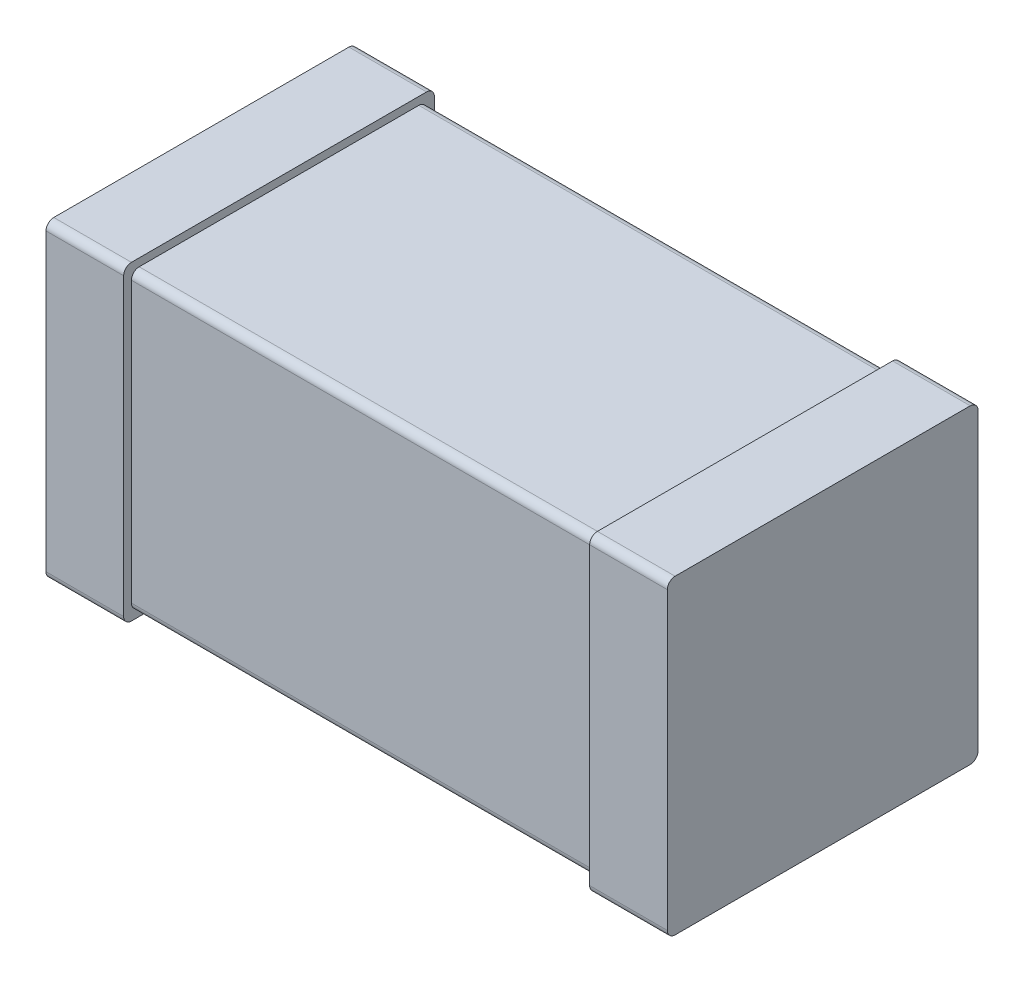
ISO-10303-21;
HEADER;
FILE_DESCRIPTION(('STEP AP214'),'2;1');
FILE_NAME('part.step','',(''),(''),'','','');
FILE_SCHEMA(('AUTOMOTIVE_DESIGN { 1 0 10303 214 1 1 1 1 }'));
ENDSEC;
DATA;
#1=APPLICATION_CONTEXT('core data for automotive mechanical design processes');
#2=APPLICATION_PROTOCOL_DEFINITION('international standard','automotive_design',2000,#1);
#3=PRODUCT_CONTEXT('',#1,'mechanical');
#4=PRODUCT('Part','Part','',(#3));
#5=PRODUCT_RELATED_PRODUCT_CATEGORY('part','',(#4));
#6=PRODUCT_DEFINITION_FORMATION('','',#4);
#7=PRODUCT_DEFINITION_CONTEXT('part definition',#1,'design');
#8=PRODUCT_DEFINITION('design','',#6,#7);
#9=PRODUCT_DEFINITION_SHAPE('','',#8);
#10=(LENGTH_UNIT() NAMED_UNIT(*) SI_UNIT(.MILLI.,.METRE.));
#11=(NAMED_UNIT(*) PLANE_ANGLE_UNIT() SI_UNIT($,.RADIAN.));
#12=(NAMED_UNIT(*) SI_UNIT($,.STERADIAN.) SOLID_ANGLE_UNIT());
#13=UNCERTAINTY_MEASURE_WITH_UNIT(LENGTH_MEASURE(1.E-05),#10,'distance_accuracy_value','');
#14=(GEOMETRIC_REPRESENTATION_CONTEXT(3) GLOBAL_UNCERTAINTY_ASSIGNED_CONTEXT((#13)) GLOBAL_UNIT_ASSIGNED_CONTEXT((#10,
#11,#12)) REPRESENTATION_CONTEXT('',''));
#15=CARTESIAN_POINT('',(0.,0.,0.));
#16=DIRECTION('',(0.,0.,1.));
#17=DIRECTION('',(1.,0.,0.));
#18=AXIS2_PLACEMENT_3D('',#15,#16,#17);
#19=CARTESIAN_POINT('',(-1.6,-0.8,0.));
#20=DIRECTION('',(1.,0.,0.));
#21=DIRECTION('',(0.,1.,0.));
#22=AXIS2_PLACEMENT_3D('',#19,#20,#21);
#23=PLANE('',#22);
#24=CARTESIAN_POINT('',(-1.6,-0.76,1.56));
#25=DIRECTION('',(-1.,0.,0.));
#26=DIRECTION('',(0.,0.,1.));
#27=AXIS2_PLACEMENT_3D('',#24,#25,#26);
#28=CIRCLE('',#27,0.04);
#29=CARTESIAN_POINT('',(-1.6,-0.8,1.56));
#30=VERTEX_POINT('',#29);
#31=CARTESIAN_POINT('',(-1.6,-0.76,1.6));
#32=VERTEX_POINT('',#31);
#33=EDGE_CURVE('E11',#30,#32,#28,.T.);
#34=ORIENTED_EDGE('',*,*,#33,.T.);
#35=DIRECTION('',(0.,1.,0.));
#36=VECTOR('',#35,1.);
#37=CARTESIAN_POINT('',(-1.6,-0.8,1.6));
#38=LINE('',#37,#36);
#39=CARTESIAN_POINT('',(-1.6,0.76,1.6));
#40=VERTEX_POINT('',#39);
#41=EDGE_CURVE('E27',#32,#40,#38,.T.);
#42=ORIENTED_EDGE('',*,*,#41,.T.);
#43=CARTESIAN_POINT('',(-1.6,0.76,1.56));
#44=DIRECTION('',(1.,0.,0.));
#45=DIRECTION('',(0.,0.,1.));
#46=AXIS2_PLACEMENT_3D('',#43,#44,#45);
#47=CIRCLE('',#46,0.04);
#48=CARTESIAN_POINT('',(-1.6,0.8,1.56));
#49=VERTEX_POINT('',#48);
#50=EDGE_CURVE('E334',#49,#40,#47,.T.);
#51=ORIENTED_EDGE('',*,*,#50,.F.);
#52=DIRECTION('',(0.,0.,1.));
#53=VECTOR('',#52,1.);
#54=CARTESIAN_POINT('',(-1.6,0.8,0.));
#55=LINE('',#54,#53);
#56=CARTESIAN_POINT('',(-1.6,0.8,0.04));
#57=VERTEX_POINT('',#56);
#58=EDGE_CURVE('E278',#57,#49,#55,.T.);
#59=ORIENTED_EDGE('',*,*,#58,.F.);
#60=CARTESIAN_POINT('',(-1.6,0.76,0.04));
#61=DIRECTION('',(-1.,0.,0.));
#62=DIRECTION('',(0.,0.,1.));
#63=AXIS2_PLACEMENT_3D('',#60,#61,#62);
#64=CIRCLE('',#63,0.04);
#65=CARTESIAN_POINT('',(-1.6,0.76,0.));
#66=VERTEX_POINT('',#65);
#67=EDGE_CURVE('E288',#57,#66,#64,.T.);
#68=ORIENTED_EDGE('',*,*,#67,.T.);
#69=DIRECTION('',(0.,1.,0.));
#70=VECTOR('',#69,1.);
#71=CARTESIAN_POINT('',(-1.6,-0.8,0.));
#72=LINE('',#71,#70);
#73=CARTESIAN_POINT('',(-1.6,-0.76,0.));
#74=VERTEX_POINT('',#73);
#75=EDGE_CURVE('E343',#74,#66,#72,.T.);
#76=ORIENTED_EDGE('',*,*,#75,.F.);
#77=CARTESIAN_POINT('',(-1.6,-0.76,0.04));
#78=DIRECTION('',(1.,0.,0.));
#79=DIRECTION('',(0.,0.,1.));
#80=AXIS2_PLACEMENT_3D('',#77,#78,#79);
#81=CIRCLE('',#80,0.04);
#82=CARTESIAN_POINT('',(-1.6,-0.8,0.04));
#83=VERTEX_POINT('',#82);
#84=EDGE_CURVE('E318',#83,#74,#81,.T.);
#85=ORIENTED_EDGE('',*,*,#84,.F.);
#86=DIRECTION('',(0.,0.,1.));
#87=VECTOR('',#86,1.);
#88=CARTESIAN_POINT('',(-1.6,-0.8,0.));
#89=LINE('',#88,#87);
#90=EDGE_CURVE('E264',#83,#30,#89,.T.);
#91=ORIENTED_EDGE('',*,*,#90,.T.);
#92=EDGE_LOOP('',(#34,#42,#51,#59,#68,#76,#85,#91));
#93=FACE_BOUND('',#92,.T.);
#94=ADVANCED_FACE('F16',(#93),#23,.F.);
#95=CARTESIAN_POINT('',(-1.6,-0.8,0.));
#96=DIRECTION('',(0.,1.,0.));
#97=DIRECTION('',(1.,0.,0.));
#98=AXIS2_PLACEMENT_3D('',#95,#96,#97);
#99=PLANE('',#98);
#100=DIRECTION('',(1.,0.,0.));
#101=VECTOR('',#100,1.);
#102=CARTESIAN_POINT('',(-1.6,-0.8,1.56));
#103=LINE('',#102,#101);
#104=CARTESIAN_POINT('',(-1.2,-0.8,1.56));
#105=VERTEX_POINT('',#104);
#106=EDGE_CURVE('E296',#30,#105,#103,.T.);
#107=ORIENTED_EDGE('',*,*,#106,.F.);
#108=ORIENTED_EDGE('',*,*,#90,.F.);
#109=DIRECTION('',(1.,0.,0.));
#110=VECTOR('',#109,1.);
#111=CARTESIAN_POINT('',(-1.6,-0.8,0.04));
#112=LINE('',#111,#110);
#113=CARTESIAN_POINT('',(-1.2,-0.8,0.04));
#114=VERTEX_POINT('',#113);
#115=EDGE_CURVE('E260',#83,#114,#112,.T.);
#116=ORIENTED_EDGE('',*,*,#115,.T.);
#117=DIRECTION('',(0.,0.,1.));
#118=VECTOR('',#117,1.);
#119=CARTESIAN_POINT('',(-1.2,-0.8,0.));
#120=LINE('',#119,#118);
#121=EDGE_CURVE('E265',#114,#105,#120,.T.);
#122=ORIENTED_EDGE('',*,*,#121,.T.);
#123=EDGE_LOOP('',(#107,#108,#116,#122));
#124=FACE_BOUND('',#123,.T.);
#125=ADVANCED_FACE('F572',(#124),#99,.F.);
#126=CARTESIAN_POINT('',(-1.6,-0.76,0.04));
#127=DIRECTION('',(1.,0.,0.));
#128=DIRECTION('',(0.,-1.,0.));
#129=AXIS2_PLACEMENT_3D('',#126,#127,#128);
#130=CYLINDRICAL_SURFACE('',#129,0.04);
#131=ORIENTED_EDGE('',*,*,#84,.T.);
#132=DIRECTION('',(1.,0.,0.));
#133=VECTOR('',#132,1.);
#134=CARTESIAN_POINT('',(-1.6,-0.76,0.));
#135=LINE('',#134,#133);
#136=CARTESIAN_POINT('',(-1.2,-0.76,0.));
#137=VERTEX_POINT('',#136);
#138=EDGE_CURVE('E322',#74,#137,#135,.T.);
#139=ORIENTED_EDGE('',*,*,#138,.T.);
#140=CARTESIAN_POINT('',(-1.2,-0.76,0.04));
#141=DIRECTION('',(1.,0.,0.));
#142=DIRECTION('',(0.,0.,1.));
#143=AXIS2_PLACEMENT_3D('',#140,#141,#142);
#144=CIRCLE('',#143,0.04);
#145=EDGE_CURVE('E279',#114,#137,#144,.T.);
#146=ORIENTED_EDGE('',*,*,#145,.F.);
#147=ORIENTED_EDGE('',*,*,#115,.F.);
#148=EDGE_LOOP('',(#131,#139,#146,#147));
#149=FACE_BOUND('',#148,.T.);
#150=ADVANCED_FACE('F576',(#149),#130,.T.);
#151=CARTESIAN_POINT('',(-1.6,-0.76,1.56));
#152=DIRECTION('',(1.,0.,0.));
#153=DIRECTION('',(0.,-1.,0.));
#154=AXIS2_PLACEMENT_3D('',#151,#152,#153);
#155=CYLINDRICAL_SURFACE('',#154,0.04);
#156=ORIENTED_EDGE('',*,*,#106,.T.);
#157=CARTESIAN_POINT('',(-1.2,-0.76,1.56));
#158=DIRECTION('',(-1.,0.,0.));
#159=DIRECTION('',(0.,0.,1.));
#160=AXIS2_PLACEMENT_3D('',#157,#158,#159);
#161=CIRCLE('',#160,0.04);
#162=CARTESIAN_POINT('',(-1.2,-0.76,1.6));
#163=VERTEX_POINT('',#162);
#164=EDGE_CURVE('E292',#105,#163,#161,.T.);
#165=ORIENTED_EDGE('',*,*,#164,.T.);
#166=DIRECTION('',(1.,0.,0.));
#167=VECTOR('',#166,1.);
#168=CARTESIAN_POINT('',(-1.6,-0.76,1.6));
#169=LINE('',#168,#167);
#170=EDGE_CURVE('E346',#32,#163,#169,.T.);
#171=ORIENTED_EDGE('',*,*,#170,.F.);
#172=ORIENTED_EDGE('',*,*,#33,.F.);
#173=EDGE_LOOP('',(#156,#165,#171,#172));
#174=FACE_BOUND('',#173,.T.);
#175=ADVANCED_FACE('F567',(#174),#155,.T.);
#176=CARTESIAN_POINT('',(-1.6,-0.8,0.));
#177=DIRECTION('',(0.,0.,1.));
#178=DIRECTION('',(1.,0.,0.));
#179=AXIS2_PLACEMENT_3D('',#176,#177,#178);
#180=PLANE('',#179);
#181=DIRECTION('',(1.,0.,0.));
#182=VECTOR('',#181,1.);
#183=CARTESIAN_POINT('',(-1.6,0.76,0.));
#184=LINE('',#183,#182);
#185=CARTESIAN_POINT('',(-1.2,0.76,0.));
#186=VERTEX_POINT('',#185);
#187=EDGE_CURVE('E297',#66,#186,#184,.T.);
#188=ORIENTED_EDGE('',*,*,#187,.T.);
#189=DIRECTION('',(0.,1.,0.));
#190=VECTOR('',#189,1.);
#191=CARTESIAN_POINT('',(-1.2,-0.8,0.));
#192=LINE('',#191,#190);
#193=EDGE_CURVE('E419',#137,#186,#192,.T.);
#194=ORIENTED_EDGE('',*,*,#193,.F.);
#195=ORIENTED_EDGE('',*,*,#138,.F.);
#196=ORIENTED_EDGE('',*,*,#75,.T.);
#197=EDGE_LOOP('',(#188,#194,#195,#196));
#198=FACE_BOUND('',#197,.T.);
#199=ADVANCED_FACE('F583',(#198),#180,.F.);
#200=CARTESIAN_POINT('',(-1.6,-0.8,1.6));
#201=DIRECTION('',(0.,0.,1.));
#202=DIRECTION('',(1.,0.,0.));
#203=AXIS2_PLACEMENT_3D('',#200,#201,#202);
#204=PLANE('',#203);
#205=ORIENTED_EDGE('',*,*,#41,.F.);
#206=ORIENTED_EDGE('',*,*,#170,.T.);
#207=DIRECTION('',(0.,1.,0.));
#208=VECTOR('',#207,1.);
#209=CARTESIAN_POINT('',(-1.2,-0.8,1.6));
#210=LINE('',#209,#208);
#211=CARTESIAN_POINT('',(-1.2,0.76,1.6));
#212=VERTEX_POINT('',#211);
#213=EDGE_CURVE('E350',#163,#212,#210,.T.);
#214=ORIENTED_EDGE('',*,*,#213,.T.);
#215=DIRECTION('',(1.,0.,0.));
#216=VECTOR('',#215,1.);
#217=CARTESIAN_POINT('',(-1.6,0.76,1.6));
#218=LINE('',#217,#216);
#219=EDGE_CURVE('E338',#40,#212,#218,.T.);
#220=ORIENTED_EDGE('',*,*,#219,.F.);
#221=EDGE_LOOP('',(#205,#206,#214,#220));
#222=FACE_BOUND('',#221,.T.);
#223=ADVANCED_FACE('F563',(#222),#204,.T.);
#224=CARTESIAN_POINT('',(-1.6,0.76,0.04));
#225=DIRECTION('',(1.,0.,0.));
#226=DIRECTION('',(0.,1.,0.));
#227=AXIS2_PLACEMENT_3D('',#224,#225,#226);
#228=CYLINDRICAL_SURFACE('',#227,0.04);
#229=DIRECTION('',(1.,0.,0.));
#230=VECTOR('',#229,1.);
#231=CARTESIAN_POINT('',(-1.6,0.8,0.04));
#232=LINE('',#231,#230);
#233=CARTESIAN_POINT('',(-1.2,0.8,0.04));
#234=VERTEX_POINT('',#233);
#235=EDGE_CURVE('E354',#57,#234,#232,.T.);
#236=ORIENTED_EDGE('',*,*,#235,.T.);
#237=CARTESIAN_POINT('',(-1.2,0.76,0.04));
#238=DIRECTION('',(-1.,0.,0.));
#239=DIRECTION('',(0.,0.,1.));
#240=AXIS2_PLACEMENT_3D('',#237,#238,#239);
#241=CIRCLE('',#240,0.04);
#242=EDGE_CURVE('E337',#234,#186,#241,.T.);
#243=ORIENTED_EDGE('',*,*,#242,.T.);
#244=ORIENTED_EDGE('',*,*,#187,.F.);
#245=ORIENTED_EDGE('',*,*,#67,.F.);
#246=EDGE_LOOP('',(#236,#243,#244,#245));
#247=FACE_BOUND('',#246,.T.);
#248=ADVANCED_FACE('F554',(#247),#228,.T.);
#249=CARTESIAN_POINT('',(-1.6,0.76,1.56));
#250=DIRECTION('',(1.,0.,0.));
#251=DIRECTION('',(0.,1.,0.));
#252=AXIS2_PLACEMENT_3D('',#249,#250,#251);
#253=CYLINDRICAL_SURFACE('',#252,0.04);
#254=ORIENTED_EDGE('',*,*,#50,.T.);
#255=ORIENTED_EDGE('',*,*,#219,.T.);
#256=CARTESIAN_POINT('',(-1.2,0.76,1.56));
#257=DIRECTION('',(1.,0.,0.));
#258=DIRECTION('',(0.,0.,1.));
#259=AXIS2_PLACEMENT_3D('',#256,#257,#258);
#260=CIRCLE('',#259,0.04);
#261=CARTESIAN_POINT('',(-1.2,0.8,1.56));
#262=VERTEX_POINT('',#261);
#263=EDGE_CURVE('E360',#262,#212,#260,.T.);
#264=ORIENTED_EDGE('',*,*,#263,.F.);
#265=DIRECTION('',(1.,0.,0.));
#266=VECTOR('',#265,1.);
#267=CARTESIAN_POINT('',(-1.6,0.8,1.56));
#268=LINE('',#267,#266);
#269=EDGE_CURVE('E274',#49,#262,#268,.T.);
#270=ORIENTED_EDGE('',*,*,#269,.F.);
#271=EDGE_LOOP('',(#254,#255,#264,#270));
#272=FACE_BOUND('',#271,.T.);
#273=ADVANCED_FACE('F562',(#272),#253,.T.);
#274=CARTESIAN_POINT('',(-1.6,0.8,0.));
#275=DIRECTION('',(0.,1.,0.));
#276=DIRECTION('',(1.,0.,0.));
#277=AXIS2_PLACEMENT_3D('',#274,#275,#276);
#278=PLANE('',#277);
#279=DIRECTION('',(0.,0.,1.));
#280=VECTOR('',#279,1.);
#281=CARTESIAN_POINT('',(-1.2,0.8,0.));
#282=LINE('',#281,#280);
#283=EDGE_CURVE('E364',#234,#262,#282,.T.);
#284=ORIENTED_EDGE('',*,*,#283,.F.);
#285=ORIENTED_EDGE('',*,*,#235,.F.);
#286=ORIENTED_EDGE('',*,*,#58,.T.);
#287=ORIENTED_EDGE('',*,*,#269,.T.);
#288=EDGE_LOOP('',(#284,#285,#286,#287));
#289=FACE_BOUND('',#288,.T.);
#290=ADVANCED_FACE('F556',(#289),#278,.T.);
#291=CARTESIAN_POINT('',(-1.2,-0.8,0.));
#292=DIRECTION('',(1.,0.,0.));
#293=DIRECTION('',(0.,1.,0.));
#294=AXIS2_PLACEMENT_3D('',#291,#292,#293);
#295=PLANE('',#294);
#296=ORIENTED_EDGE('',*,*,#121,.F.);
#297=ORIENTED_EDGE('',*,*,#145,.T.);
#298=ORIENTED_EDGE('',*,*,#193,.T.);
#299=ORIENTED_EDGE('',*,*,#242,.F.);
#300=ORIENTED_EDGE('',*,*,#283,.T.);
#301=ORIENTED_EDGE('',*,*,#263,.T.);
#302=ORIENTED_EDGE('',*,*,#213,.F.);
#303=ORIENTED_EDGE('',*,*,#164,.F.);
#304=EDGE_LOOP('',(#296,#297,#298,#299,#300,#301,#302,#303));
#305=FACE_BOUND('',#304,.T.);
#306=CARTESIAN_POINT('',(-1.2,-0.72,0.08));
#307=DIRECTION('',(1.,0.,0.));
#308=DIRECTION('',(0.,0.,1.));
#309=AXIS2_PLACEMENT_3D('',#306,#307,#308);
#310=CIRCLE('',#309,0.04);
#311=CARTESIAN_POINT('',(-1.2,-0.76,0.08));
#312=VERTEX_POINT('',#311);
#313=CARTESIAN_POINT('',(-1.2,-0.72,0.04));
#314=VERTEX_POINT('',#313);
#315=EDGE_CURVE('E244',#312,#314,#310,.T.);
#316=ORIENTED_EDGE('',*,*,#315,.F.);
#317=DIRECTION('',(0.,0.,1.));
#318=VECTOR('',#317,1.);
#319=CARTESIAN_POINT('',(-1.2,-0.76,0.04));
#320=LINE('',#319,#318);
#321=CARTESIAN_POINT('',(-1.2,-0.76,1.52));
#322=VERTEX_POINT('',#321);
#323=EDGE_CURVE('E272',#312,#322,#320,.T.);
#324=ORIENTED_EDGE('',*,*,#323,.T.);
#325=CARTESIAN_POINT('',(-1.2,-0.72,1.52));
#326=DIRECTION('',(-1.,0.,0.));
#327=DIRECTION('',(0.,0.,1.));
#328=AXIS2_PLACEMENT_3D('',#325,#326,#327);
#329=CIRCLE('',#328,0.04);
#330=CARTESIAN_POINT('',(-1.2,-0.72,1.56));
#331=VERTEX_POINT('',#330);
#332=EDGE_CURVE('E268',#322,#331,#329,.T.);
#333=ORIENTED_EDGE('',*,*,#332,.T.);
#334=DIRECTION('',(0.,1.,0.));
#335=VECTOR('',#334,1.);
#336=CARTESIAN_POINT('',(-1.2,-0.76,1.56));
#337=LINE('',#336,#335);
#338=CARTESIAN_POINT('',(-1.2,0.72,1.56));
#339=VERTEX_POINT('',#338);
#340=EDGE_CURVE('E273',#331,#339,#337,.T.);
#341=ORIENTED_EDGE('',*,*,#340,.T.);
#342=CARTESIAN_POINT('',(-1.2,0.72,1.52));
#343=DIRECTION('',(1.,0.,0.));
#344=DIRECTION('',(0.,0.,1.));
#345=AXIS2_PLACEMENT_3D('',#342,#343,#344);
#346=CIRCLE('',#345,0.04);
#347=CARTESIAN_POINT('',(-1.2,0.76,1.52));
#348=VERTEX_POINT('',#347);
#349=EDGE_CURVE('E254',#348,#339,#346,.T.);
#350=ORIENTED_EDGE('',*,*,#349,.F.);
#351=DIRECTION('',(0.,0.,1.));
#352=VECTOR('',#351,1.);
#353=CARTESIAN_POINT('',(-1.2,0.76,0.04));
#354=LINE('',#353,#352);
#355=CARTESIAN_POINT('',(-1.2,0.76,0.08));
#356=VERTEX_POINT('',#355);
#357=EDGE_CURVE('E253',#356,#348,#354,.T.);
#358=ORIENTED_EDGE('',*,*,#357,.F.);
#359=CARTESIAN_POINT('',(-1.2,0.72,0.08));
#360=DIRECTION('',(-1.,0.,0.));
#361=DIRECTION('',(0.,0.,1.));
#362=AXIS2_PLACEMENT_3D('',#359,#360,#361);
#363=CIRCLE('',#362,0.04);
#364=CARTESIAN_POINT('',(-1.2,0.72,0.04));
#365=VERTEX_POINT('',#364);
#366=EDGE_CURVE('E247',#356,#365,#363,.T.);
#367=ORIENTED_EDGE('',*,*,#366,.T.);
#368=DIRECTION('',(0.,1.,0.));
#369=VECTOR('',#368,1.);
#370=CARTESIAN_POINT('',(-1.2,-0.76,0.04));
#371=LINE('',#370,#369);
#372=EDGE_CURVE('E396',#314,#365,#371,.T.);
#373=ORIENTED_EDGE('',*,*,#372,.F.);
#374=EDGE_LOOP('',(#316,#324,#333,#341,#350,#358,#367,#373));
#375=FACE_BOUND('',#374,.T.);
#376=ADVANCED_FACE('F445',(#305,#375),#295,.T.);
#377=CARTESIAN_POINT('',(-1.2,-0.72,0.08));
#378=DIRECTION('',(1.,0.,0.));
#379=DIRECTION('',(0.,-1.,0.));
#380=AXIS2_PLACEMENT_3D('',#377,#378,#379);
#381=CYLINDRICAL_SURFACE('',#380,0.04);
#382=ORIENTED_EDGE('',*,*,#315,.T.);
#383=DIRECTION('',(1.,0.,0.));
#384=VECTOR('',#383,1.);
#385=CARTESIAN_POINT('',(-1.2,-0.72,0.04));
#386=LINE('',#385,#384);
#387=CARTESIAN_POINT('',(1.2,-0.72,0.04));
#388=VERTEX_POINT('',#387);
#389=EDGE_CURVE('E248',#314,#388,#386,.T.);
#390=ORIENTED_EDGE('',*,*,#389,.T.);
#391=CARTESIAN_POINT('',(1.2,-0.72,0.08));
#392=DIRECTION('',(1.,0.,0.));
#393=DIRECTION('',(0.,0.,1.));
#394=AXIS2_PLACEMENT_3D('',#391,#392,#393);
#395=CIRCLE('',#394,0.04);
#396=CARTESIAN_POINT('',(1.2,-0.76,0.08));
#397=VERTEX_POINT('',#396);
#398=EDGE_CURVE('E370',#397,#388,#395,.T.);
#399=ORIENTED_EDGE('',*,*,#398,.F.);
#400=DIRECTION('',(1.,0.,0.));
#401=VECTOR('',#400,1.);
#402=CARTESIAN_POINT('',(-1.2,-0.76,0.08));
#403=LINE('',#402,#401);
#404=EDGE_CURVE('E311',#312,#397,#403,.T.);
#405=ORIENTED_EDGE('',*,*,#404,.F.);
#406=EDGE_LOOP('',(#382,#390,#399,#405));
#407=FACE_BOUND('',#406,.T.);
#408=ADVANCED_FACE('F493',(#407),#381,.T.);
#409=CARTESIAN_POINT('',(-1.2,-0.76,0.04));
#410=DIRECTION('',(0.,0.,1.));
#411=DIRECTION('',(1.,0.,0.));
#412=AXIS2_PLACEMENT_3D('',#409,#410,#411);
#413=PLANE('',#412);
#414=DIRECTION('',(1.,0.,0.));
#415=VECTOR('',#414,1.);
#416=CARTESIAN_POINT('',(-1.2,0.72,0.04));
#417=LINE('',#416,#415);
#418=CARTESIAN_POINT('',(1.2,0.72,0.04));
#419=VERTEX_POINT('',#418);
#420=EDGE_CURVE('E342',#365,#419,#417,.T.);
#421=ORIENTED_EDGE('',*,*,#420,.T.);
#422=DIRECTION('',(0.,1.,0.));
#423=VECTOR('',#422,1.);
#424=CARTESIAN_POINT('',(1.2,-0.76,0.04));
#425=LINE('',#424,#423);
#426=EDGE_CURVE('E214',#388,#419,#425,.T.);
#427=ORIENTED_EDGE('',*,*,#426,.F.);
#428=ORIENTED_EDGE('',*,*,#389,.F.);
#429=ORIENTED_EDGE('',*,*,#372,.T.);
#430=EDGE_LOOP('',(#421,#427,#428,#429));
#431=FACE_BOUND('',#430,.T.);
#432=ADVANCED_FACE('F495',(#431),#413,.F.);
#433=CARTESIAN_POINT('',(-1.2,0.72,0.08));
#434=DIRECTION('',(1.,0.,0.));
#435=DIRECTION('',(0.,1.,0.));
#436=AXIS2_PLACEMENT_3D('',#433,#434,#435);
#437=CYLINDRICAL_SURFACE('',#436,0.04);
#438=DIRECTION('',(1.,0.,0.));
#439=VECTOR('',#438,1.);
#440=CARTESIAN_POINT('',(-1.2,0.76,0.08));
#441=LINE('',#440,#439);
#442=CARTESIAN_POINT('',(1.2,0.76,0.08));
#443=VERTEX_POINT('',#442);
#444=EDGE_CURVE('E393',#356,#443,#441,.T.);
#445=ORIENTED_EDGE('',*,*,#444,.T.);
#446=CARTESIAN_POINT('',(1.2,0.72,0.08));
#447=DIRECTION('',(-1.,0.,0.));
#448=DIRECTION('',(0.,0.,1.));
#449=AXIS2_PLACEMENT_3D('',#446,#447,#448);
#450=CIRCLE('',#449,0.04);
#451=EDGE_CURVE('E242',#443,#419,#450,.T.);
#452=ORIENTED_EDGE('',*,*,#451,.T.);
#453=ORIENTED_EDGE('',*,*,#420,.F.);
#454=ORIENTED_EDGE('',*,*,#366,.F.);
#455=EDGE_LOOP('',(#445,#452,#453,#454));
#456=FACE_BOUND('',#455,.T.);
#457=ADVANCED_FACE('F607',(#456),#437,.T.);
#458=CARTESIAN_POINT('',(-1.2,0.76,0.04));
#459=DIRECTION('',(0.,1.,0.));
#460=DIRECTION('',(1.,0.,0.));
#461=AXIS2_PLACEMENT_3D('',#458,#459,#460);
#462=PLANE('',#461);
#463=DIRECTION('',(0.,0.,1.));
#464=VECTOR('',#463,1.);
#465=CARTESIAN_POINT('',(1.2,0.76,0.04));
#466=LINE('',#465,#464);
#467=CARTESIAN_POINT('',(1.2,0.76,1.52));
#468=VERTEX_POINT('',#467);
#469=EDGE_CURVE('E280',#443,#468,#466,.T.);
#470=ORIENTED_EDGE('',*,*,#469,.F.);
#471=ORIENTED_EDGE('',*,*,#444,.F.);
#472=ORIENTED_EDGE('',*,*,#357,.T.);
#473=DIRECTION('',(1.,0.,0.));
#474=VECTOR('',#473,1.);
#475=CARTESIAN_POINT('',(-1.2,0.76,1.52));
#476=LINE('',#475,#474);
#477=EDGE_CURVE('E249',#348,#468,#476,.T.);
#478=ORIENTED_EDGE('',*,*,#477,.T.);
#479=EDGE_LOOP('',(#470,#471,#472,#478));
#480=FACE_BOUND('',#479,.T.);
#481=ADVANCED_FACE('F603',(#480),#462,.T.);
#482=CARTESIAN_POINT('',(-1.2,0.72,1.52));
#483=DIRECTION('',(1.,0.,0.));
#484=DIRECTION('',(0.,1.,0.));
#485=AXIS2_PLACEMENT_3D('',#482,#483,#484);
#486=CYLINDRICAL_SURFACE('',#485,0.04);
#487=ORIENTED_EDGE('',*,*,#349,.T.);
#488=DIRECTION('',(1.,0.,0.));
#489=VECTOR('',#488,1.);
#490=CARTESIAN_POINT('',(-1.2,0.72,1.56));
#491=LINE('',#490,#489);
#492=CARTESIAN_POINT('',(1.2,0.72,1.56));
#493=VERTEX_POINT('',#492);
#494=EDGE_CURVE('E323',#339,#493,#491,.T.);
#495=ORIENTED_EDGE('',*,*,#494,.T.);
#496=CARTESIAN_POINT('',(1.2,0.72,1.52));
#497=DIRECTION('',(1.,0.,0.));
#498=DIRECTION('',(0.,0.,1.));
#499=AXIS2_PLACEMENT_3D('',#496,#497,#498);
#500=CIRCLE('',#499,0.04);
#501=EDGE_CURVE('E284',#468,#493,#500,.T.);
#502=ORIENTED_EDGE('',*,*,#501,.F.);
#503=ORIENTED_EDGE('',*,*,#477,.F.);
#504=EDGE_LOOP('',(#487,#495,#502,#503));
#505=FACE_BOUND('',#504,.T.);
#506=ADVANCED_FACE('F606',(#505),#486,.T.);
#507=CARTESIAN_POINT('',(-1.2,-0.76,1.56));
#508=DIRECTION('',(0.,0.,1.));
#509=DIRECTION('',(1.,0.,0.));
#510=AXIS2_PLACEMENT_3D('',#507,#508,#509);
#511=PLANE('',#510);
#512=ORIENTED_EDGE('',*,*,#340,.F.);
#513=DIRECTION('',(1.,0.,0.));
#514=VECTOR('',#513,1.);
#515=CARTESIAN_POINT('',(-1.2,-0.72,1.56));
#516=LINE('',#515,#514);
#517=CARTESIAN_POINT('',(1.2,-0.72,1.56));
#518=VERTEX_POINT('',#517);
#519=EDGE_CURVE('E326',#331,#518,#516,.T.);
#520=ORIENTED_EDGE('',*,*,#519,.T.);
#521=DIRECTION('',(0.,1.,0.));
#522=VECTOR('',#521,1.);
#523=CARTESIAN_POINT('',(1.2,-0.76,1.56));
#524=LINE('',#523,#522);
#525=EDGE_CURVE('E384',#518,#493,#524,.T.);
#526=ORIENTED_EDGE('',*,*,#525,.T.);
#527=ORIENTED_EDGE('',*,*,#494,.F.);
#528=EDGE_LOOP('',(#512,#520,#526,#527));
#529=FACE_BOUND('',#528,.T.);
#530=ADVANCED_FACE('F456',(#529),#511,.T.);
#531=CARTESIAN_POINT('',(-1.2,-0.72,1.52));
#532=DIRECTION('',(1.,0.,0.));
#533=DIRECTION('',(0.,-1.,0.));
#534=AXIS2_PLACEMENT_3D('',#531,#532,#533);
#535=CYLINDRICAL_SURFACE('',#534,0.04);
#536=DIRECTION('',(1.,0.,0.));
#537=VECTOR('',#536,1.);
#538=CARTESIAN_POINT('',(-1.2,-0.76,1.52));
#539=LINE('',#538,#537);
#540=CARTESIAN_POINT('',(1.2,-0.76,1.52));
#541=VERTEX_POINT('',#540);
#542=EDGE_CURVE('E380',#322,#541,#539,.T.);
#543=ORIENTED_EDGE('',*,*,#542,.T.);
#544=CARTESIAN_POINT('',(1.2,-0.72,1.52));
#545=DIRECTION('',(-1.,0.,0.));
#546=DIRECTION('',(0.,0.,1.));
#547=AXIS2_PLACEMENT_3D('',#544,#545,#546);
#548=CIRCLE('',#547,0.04);
#549=EDGE_CURVE('E333',#541,#518,#548,.T.);
#550=ORIENTED_EDGE('',*,*,#549,.T.);
#551=ORIENTED_EDGE('',*,*,#519,.F.);
#552=ORIENTED_EDGE('',*,*,#332,.F.);
#553=EDGE_LOOP('',(#543,#550,#551,#552));
#554=FACE_BOUND('',#553,.T.);
#555=ADVANCED_FACE('F454',(#554),#535,.T.);
#556=CARTESIAN_POINT('',(-1.2,-0.76,0.04));
#557=DIRECTION('',(0.,1.,0.));
#558=DIRECTION('',(1.,0.,0.));
#559=AXIS2_PLACEMENT_3D('',#556,#557,#558);
#560=PLANE('',#559);
#561=ORIENTED_EDGE('',*,*,#542,.F.);
#562=ORIENTED_EDGE('',*,*,#323,.F.);
#563=ORIENTED_EDGE('',*,*,#404,.T.);
#564=DIRECTION('',(0.,0.,1.));
#565=VECTOR('',#564,1.);
#566=CARTESIAN_POINT('',(1.2,-0.76,0.04));
#567=LINE('',#566,#565);
#568=EDGE_CURVE('E221',#397,#541,#567,.T.);
#569=ORIENTED_EDGE('',*,*,#568,.T.);
#570=EDGE_LOOP('',(#561,#562,#563,#569));
#571=FACE_BOUND('',#570,.T.);
#572=ADVANCED_FACE('F450',(#571),#560,.F.);
#573=CARTESIAN_POINT('',(1.2,-0.8,0.));
#574=DIRECTION('',(1.,0.,0.));
#575=DIRECTION('',(0.,1.,0.));
#576=AXIS2_PLACEMENT_3D('',#573,#574,#575);
#577=PLANE('',#576);
#578=CARTESIAN_POINT('',(1.2,-0.76,1.56));
#579=DIRECTION('',(-1.,0.,0.));
#580=DIRECTION('',(0.,0.,1.));
#581=AXIS2_PLACEMENT_3D('',#578,#579,#580);
#582=CIRCLE('',#581,0.04);
#583=CARTESIAN_POINT('',(1.2,-0.8,1.56));
#584=VERTEX_POINT('',#583);
#585=CARTESIAN_POINT('',(1.2,-0.76,1.6));
#586=VERTEX_POINT('',#585);
#587=EDGE_CURVE('E205',#584,#586,#582,.T.);
#588=ORIENTED_EDGE('',*,*,#587,.T.);
#589=DIRECTION('',(0.,1.,0.));
#590=VECTOR('',#589,1.);
#591=CARTESIAN_POINT('',(1.2,-0.8,1.6));
#592=LINE('',#591,#590);
#593=CARTESIAN_POINT('',(1.2,0.76,1.6));
#594=VERTEX_POINT('',#593);
#595=EDGE_CURVE('E222',#586,#594,#592,.T.);
#596=ORIENTED_EDGE('',*,*,#595,.T.);
#597=CARTESIAN_POINT('',(1.2,0.76,1.56));
#598=DIRECTION('',(1.,0.,0.));
#599=DIRECTION('',(0.,0.,1.));
#600=AXIS2_PLACEMENT_3D('',#597,#598,#599);
#601=CIRCLE('',#600,0.04);
#602=CARTESIAN_POINT('',(1.2,0.8,1.56));
#603=VERTEX_POINT('',#602);
#604=EDGE_CURVE('E257',#603,#594,#601,.T.);
#605=ORIENTED_EDGE('',*,*,#604,.F.);
#606=DIRECTION('',(0.,0.,1.));
#607=VECTOR('',#606,1.);
#608=CARTESIAN_POINT('',(1.2,0.8,0.));
#609=LINE('',#608,#607);
#610=CARTESIAN_POINT('',(1.2,0.8,0.04));
#611=VERTEX_POINT('',#610);
#612=EDGE_CURVE('E258',#611,#603,#609,.T.);
#613=ORIENTED_EDGE('',*,*,#612,.F.);
#614=CARTESIAN_POINT('',(1.2,0.76,0.04));
#615=DIRECTION('',(-1.,0.,0.));
#616=DIRECTION('',(0.,0.,1.));
#617=AXIS2_PLACEMENT_3D('',#614,#615,#616);
#618=CIRCLE('',#617,0.04);
#619=CARTESIAN_POINT('',(1.2,0.76,0.));
#620=VERTEX_POINT('',#619);
#621=EDGE_CURVE('E213',#611,#620,#618,.T.);
#622=ORIENTED_EDGE('',*,*,#621,.T.);
#623=DIRECTION('',(0.,1.,0.));
#624=VECTOR('',#623,1.);
#625=CARTESIAN_POINT('',(1.2,-0.8,0.));
#626=LINE('',#625,#624);
#627=CARTESIAN_POINT('',(1.2,-0.76,0.));
#628=VERTEX_POINT('',#627);
#629=EDGE_CURVE('E304',#628,#620,#626,.T.);
#630=ORIENTED_EDGE('',*,*,#629,.F.);
#631=CARTESIAN_POINT('',(1.2,-0.76,0.04));
#632=DIRECTION('',(1.,0.,0.));
#633=DIRECTION('',(0.,0.,1.));
#634=AXIS2_PLACEMENT_3D('',#631,#632,#633);
#635=CIRCLE('',#634,0.04);
#636=CARTESIAN_POINT('',(1.2,-0.8,0.04));
#637=VERTEX_POINT('',#636);
#638=EDGE_CURVE('E207',#637,#628,#635,.T.);
#639=ORIENTED_EDGE('',*,*,#638,.F.);
#640=DIRECTION('',(0.,0.,1.));
#641=VECTOR('',#640,1.);
#642=CARTESIAN_POINT('',(1.2,-0.8,0.));
#643=LINE('',#642,#641);
#644=EDGE_CURVE('E200',#637,#584,#643,.T.);
#645=ORIENTED_EDGE('',*,*,#644,.T.);
#646=EDGE_LOOP('',(#588,#596,#605,#613,#622,#630,#639,#645));
#647=FACE_BOUND('',#646,.T.);
#648=ORIENTED_EDGE('',*,*,#426,.T.);
#649=ORIENTED_EDGE('',*,*,#451,.F.);
#650=ORIENTED_EDGE('',*,*,#469,.T.);
#651=ORIENTED_EDGE('',*,*,#501,.T.);
#652=ORIENTED_EDGE('',*,*,#525,.F.);
#653=ORIENTED_EDGE('',*,*,#549,.F.);
#654=ORIENTED_EDGE('',*,*,#568,.F.);
#655=ORIENTED_EDGE('',*,*,#398,.T.);
#656=EDGE_LOOP('',(#648,#649,#650,#651,#652,#653,#654,#655));
#657=FACE_BOUND('',#656,.T.);
#658=ADVANCED_FACE('F202',(#647,#657),#577,.F.);
#659=CARTESIAN_POINT('',(1.2,-0.8,0.));
#660=DIRECTION('',(0.,1.,0.));
#661=DIRECTION('',(1.,0.,0.));
#662=AXIS2_PLACEMENT_3D('',#659,#660,#661);
#663=PLANE('',#662);
#664=DIRECTION('',(1.,0.,0.));
#665=VECTOR('',#664,1.);
#666=CARTESIAN_POINT('',(1.2,-0.8,1.56));
#667=LINE('',#666,#665);
#668=CARTESIAN_POINT('',(1.6,-0.8,1.56));
#669=VERTEX_POINT('',#668);
#670=EDGE_CURVE('E218',#584,#669,#667,.T.);
#671=ORIENTED_EDGE('',*,*,#670,.F.);
#672=ORIENTED_EDGE('',*,*,#644,.F.);
#673=DIRECTION('',(1.,0.,0.));
#674=VECTOR('',#673,1.);
#675=CARTESIAN_POINT('',(1.2,-0.8,0.04));
#676=LINE('',#675,#674);
#677=CARTESIAN_POINT('',(1.6,-0.8,0.04));
#678=VERTEX_POINT('',#677);
#679=EDGE_CURVE('E367',#637,#678,#676,.T.);
#680=ORIENTED_EDGE('',*,*,#679,.T.);
#681=DIRECTION('',(0.,0.,1.));
#682=VECTOR('',#681,1.);
#683=CARTESIAN_POINT('',(1.6,-0.8,0.));
#684=LINE('',#683,#682);
#685=EDGE_CURVE('E225',#678,#669,#684,.T.);
#686=ORIENTED_EDGE('',*,*,#685,.T.);
#687=EDGE_LOOP('',(#671,#672,#680,#686));
#688=FACE_BOUND('',#687,.T.);
#689=ADVANCED_FACE('F224',(#688),#663,.F.);
#690=CARTESIAN_POINT('',(1.2,-0.76,0.04));
#691=DIRECTION('',(1.,0.,0.));
#692=DIRECTION('',(0.,-1.,0.));
#693=AXIS2_PLACEMENT_3D('',#690,#691,#692);
#694=CYLINDRICAL_SURFACE('',#693,0.04);
#695=ORIENTED_EDGE('',*,*,#638,.T.);
#696=DIRECTION('',(1.,0.,0.));
#697=VECTOR('',#696,1.);
#698=CARTESIAN_POINT('',(1.2,-0.76,0.));
#699=LINE('',#698,#697);
#700=CARTESIAN_POINT('',(1.6,-0.76,0.));
#701=VERTEX_POINT('',#700);
#702=EDGE_CURVE('E228',#628,#701,#699,.T.);
#703=ORIENTED_EDGE('',*,*,#702,.T.);
#704=CARTESIAN_POINT('',(1.6,-0.76,0.04));
#705=DIRECTION('',(1.,0.,0.));
#706=DIRECTION('',(0.,0.,1.));
#707=AXIS2_PLACEMENT_3D('',#704,#705,#706);
#708=CIRCLE('',#707,0.04);
#709=EDGE_CURVE('E392',#678,#701,#708,.T.);
#710=ORIENTED_EDGE('',*,*,#709,.F.);
#711=ORIENTED_EDGE('',*,*,#679,.F.);
#712=EDGE_LOOP('',(#695,#703,#710,#711));
#713=FACE_BOUND('',#712,.T.);
#714=ADVANCED_FACE('F18',(#713),#694,.T.);
#715=CARTESIAN_POINT('',(1.2,-0.76,1.56));
#716=DIRECTION('',(1.,0.,0.));
#717=DIRECTION('',(0.,-1.,0.));
#718=AXIS2_PLACEMENT_3D('',#715,#716,#717);
#719=CYLINDRICAL_SURFACE('',#718,0.04);
#720=ORIENTED_EDGE('',*,*,#670,.T.);
#721=CARTESIAN_POINT('',(1.6,-0.76,1.56));
#722=DIRECTION('',(-1.,0.,0.));
#723=DIRECTION('',(0.,0.,1.));
#724=AXIS2_PLACEMENT_3D('',#721,#722,#723);
#725=CIRCLE('',#724,0.04);
#726=CARTESIAN_POINT('',(1.6,-0.76,1.6));
#727=VERTEX_POINT('',#726);
#728=EDGE_CURVE('E229',#669,#727,#725,.T.);
#729=ORIENTED_EDGE('',*,*,#728,.T.);
#730=DIRECTION('',(1.,0.,0.));
#731=VECTOR('',#730,1.);
#732=CARTESIAN_POINT('',(1.2,-0.76,1.6));
#733=LINE('',#732,#731);
#734=EDGE_CURVE('E156',#586,#727,#733,.T.);
#735=ORIENTED_EDGE('',*,*,#734,.F.);
#736=ORIENTED_EDGE('',*,*,#587,.F.);
#737=EDGE_LOOP('',(#720,#729,#735,#736));
#738=FACE_BOUND('',#737,.T.);
#739=ADVANCED_FACE('F217',(#738),#719,.T.);
#740=CARTESIAN_POINT('',(1.2,-0.8,0.));
#741=DIRECTION('',(0.,0.,1.));
#742=DIRECTION('',(1.,0.,0.));
#743=AXIS2_PLACEMENT_3D('',#740,#741,#742);
#744=PLANE('',#743);
#745=DIRECTION('',(1.,0.,0.));
#746=VECTOR('',#745,1.);
#747=CARTESIAN_POINT('',(1.2,0.76,0.));
#748=LINE('',#747,#746);
#749=CARTESIAN_POINT('',(1.6,0.76,0.));
#750=VERTEX_POINT('',#749);
#751=EDGE_CURVE('E238',#620,#750,#748,.T.);
#752=ORIENTED_EDGE('',*,*,#751,.T.);
#753=DIRECTION('',(0.,1.,0.));
#754=VECTOR('',#753,1.);
#755=CARTESIAN_POINT('',(1.6,-0.8,0.));
#756=LINE('',#755,#754);
#757=EDGE_CURVE('E167',#701,#750,#756,.T.);
#758=ORIENTED_EDGE('',*,*,#757,.F.);
#759=ORIENTED_EDGE('',*,*,#702,.F.);
#760=ORIENTED_EDGE('',*,*,#629,.T.);
#761=EDGE_LOOP('',(#752,#758,#759,#760));
#762=FACE_BOUND('',#761,.T.);
#763=ADVANCED_FACE('F643',(#762),#744,.F.);
#764=CARTESIAN_POINT('',(1.2,-0.8,1.6));
#765=DIRECTION('',(0.,0.,1.));
#766=DIRECTION('',(1.,0.,0.));
#767=AXIS2_PLACEMENT_3D('',#764,#765,#766);
#768=PLANE('',#767);
#769=ORIENTED_EDGE('',*,*,#595,.F.);
#770=ORIENTED_EDGE('',*,*,#734,.T.);
#771=DIRECTION('',(0.,1.,0.));
#772=VECTOR('',#771,1.);
#773=CARTESIAN_POINT('',(1.6,-0.8,1.6));
#774=LINE('',#773,#772);
#775=CARTESIAN_POINT('',(1.6,0.76,1.6));
#776=VERTEX_POINT('',#775);
#777=EDGE_CURVE('E305',#727,#776,#774,.T.);
#778=ORIENTED_EDGE('',*,*,#777,.T.);
#779=DIRECTION('',(1.,0.,0.));
#780=VECTOR('',#779,1.);
#781=CARTESIAN_POINT('',(1.2,0.76,1.6));
#782=LINE('',#781,#780);
#783=EDGE_CURVE('E255',#594,#776,#782,.T.);
#784=ORIENTED_EDGE('',*,*,#783,.F.);
#785=EDGE_LOOP('',(#769,#770,#778,#784));
#786=FACE_BOUND('',#785,.T.);
#787=ADVANCED_FACE('F614',(#786),#768,.T.);
#788=CARTESIAN_POINT('',(1.2,0.76,0.04));
#789=DIRECTION('',(1.,0.,0.));
#790=DIRECTION('',(0.,1.,0.));
#791=AXIS2_PLACEMENT_3D('',#788,#789,#790);
#792=CYLINDRICAL_SURFACE('',#791,0.04);
#793=DIRECTION('',(1.,0.,0.));
#794=VECTOR('',#793,1.);
#795=CARTESIAN_POINT('',(1.2,0.8,0.04));
#796=LINE('',#795,#794);
#797=CARTESIAN_POINT('',(1.6,0.8,0.04));
#798=VERTEX_POINT('',#797);
#799=EDGE_CURVE('E20',#611,#798,#796,.T.);
#800=ORIENTED_EDGE('',*,*,#799,.T.);
#801=CARTESIAN_POINT('',(1.6,0.76,0.04));
#802=DIRECTION('',(-1.,0.,0.));
#803=DIRECTION('',(0.,0.,1.));
#804=AXIS2_PLACEMENT_3D('',#801,#802,#803);
#805=CIRCLE('',#804,0.04);
#806=EDGE_CURVE('E314',#798,#750,#805,.T.);
#807=ORIENTED_EDGE('',*,*,#806,.T.);
#808=ORIENTED_EDGE('',*,*,#751,.F.);
#809=ORIENTED_EDGE('',*,*,#621,.F.);
#810=EDGE_LOOP('',(#800,#807,#808,#809));
#811=FACE_BOUND('',#810,.T.);
#812=ADVANCED_FACE('F611',(#811),#792,.T.);
#813=CARTESIAN_POINT('',(1.2,0.76,1.56));
#814=DIRECTION('',(1.,0.,0.));
#815=DIRECTION('',(0.,1.,0.));
#816=AXIS2_PLACEMENT_3D('',#813,#814,#815);
#817=CYLINDRICAL_SURFACE('',#816,0.04);
#818=ORIENTED_EDGE('',*,*,#604,.T.);
#819=ORIENTED_EDGE('',*,*,#783,.T.);
#820=CARTESIAN_POINT('',(1.6,0.76,1.56));
#821=DIRECTION('',(1.,0.,0.));
#822=DIRECTION('',(0.,0.,1.));
#823=AXIS2_PLACEMENT_3D('',#820,#821,#822);
#824=CIRCLE('',#823,0.04);
#825=CARTESIAN_POINT('',(1.6,0.8,1.56));
#826=VERTEX_POINT('',#825);
#827=EDGE_CURVE('E474',#826,#776,#824,.T.);
#828=ORIENTED_EDGE('',*,*,#827,.F.);
#829=DIRECTION('',(1.,0.,0.));
#830=VECTOR('',#829,1.);
#831=CARTESIAN_POINT('',(1.2,0.8,1.56));
#832=LINE('',#831,#830);
#833=EDGE_CURVE('E301',#603,#826,#832,.T.);
#834=ORIENTED_EDGE('',*,*,#833,.F.);
#835=EDGE_LOOP('',(#818,#819,#828,#834));
#836=FACE_BOUND('',#835,.T.);
#837=ADVANCED_FACE('F533',(#836),#817,.T.);
#838=CARTESIAN_POINT('',(1.2,0.8,0.));
#839=DIRECTION('',(0.,1.,0.));
#840=DIRECTION('',(1.,0.,0.));
#841=AXIS2_PLACEMENT_3D('',#838,#839,#840);
#842=PLANE('',#841);
#843=DIRECTION('',(0.,0.,1.));
#844=VECTOR('',#843,1.);
#845=CARTESIAN_POINT('',(1.6,0.8,0.));
#846=LINE('',#845,#844);
#847=EDGE_CURVE('E522',#798,#826,#846,.T.);
#848=ORIENTED_EDGE('',*,*,#847,.F.);
#849=ORIENTED_EDGE('',*,*,#799,.F.);
#850=ORIENTED_EDGE('',*,*,#612,.T.);
#851=ORIENTED_EDGE('',*,*,#833,.T.);
#852=EDGE_LOOP('',(#848,#849,#850,#851));
#853=FACE_BOUND('',#852,.T.);
#854=ADVANCED_FACE('F531',(#853),#842,.T.);
#855=CARTESIAN_POINT('',(1.6,-0.8,0.));
#856=DIRECTION('',(1.,0.,0.));
#857=DIRECTION('',(0.,1.,0.));
#858=AXIS2_PLACEMENT_3D('',#855,#856,#857);
#859=PLANE('',#858);
#860=ORIENTED_EDGE('',*,*,#685,.F.);
#861=ORIENTED_EDGE('',*,*,#709,.T.);
#862=ORIENTED_EDGE('',*,*,#757,.T.);
#863=ORIENTED_EDGE('',*,*,#806,.F.);
#864=ORIENTED_EDGE('',*,*,#847,.T.);
#865=ORIENTED_EDGE('',*,*,#827,.T.);
#866=ORIENTED_EDGE('',*,*,#777,.F.);
#867=ORIENTED_EDGE('',*,*,#728,.F.);
#868=EDGE_LOOP('',(#860,#861,#862,#863,#864,#865,#866,#867));
#869=FACE_BOUND('',#868,.T.);
#870=ADVANCED_FACE('F527',(#869),#859,.T.);
#871=CLOSED_SHELL('',(#94,#125,#150,#175,#199,#223,#248,#273,#290,#376,#408,#432,#457,#481,#506,
#530,#555,#572,#658,#689,#714,#739,#763,#787,#812,#837,#854,#870));
#872=MANIFOLD_SOLID_BREP('B1',#871);
#873=ADVANCED_BREP_SHAPE_REPRESENTATION('',(#18,#872),#14);
#874=SHAPE_DEFINITION_REPRESENTATION(#9,#873);
ENDSEC;
END-ISO-10303-21;
